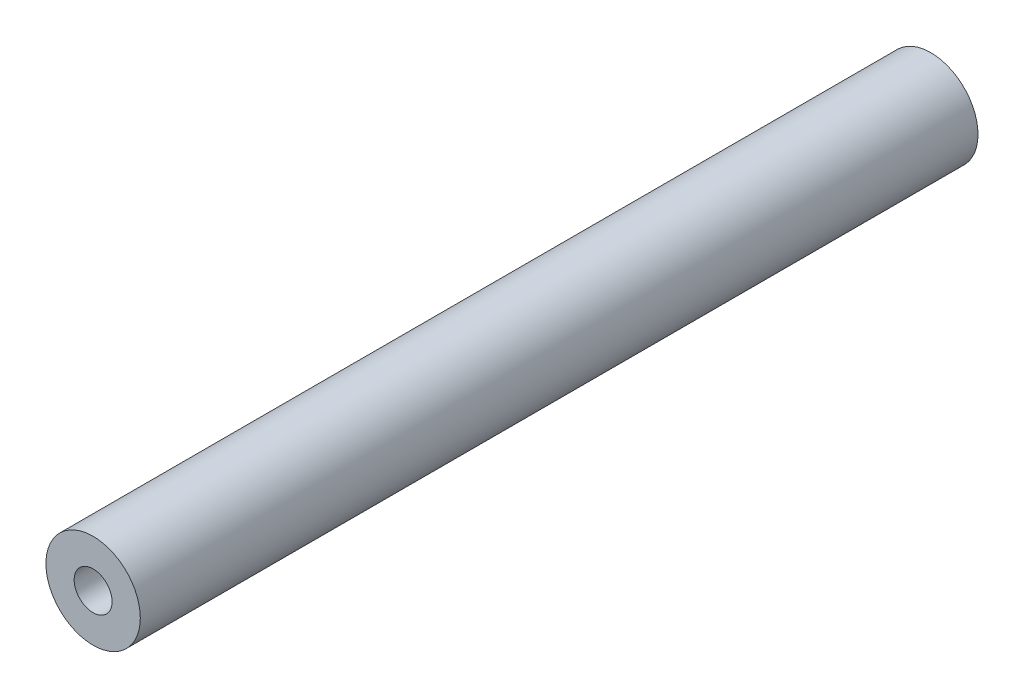
ISO-10303-21;
HEADER;
FILE_DESCRIPTION(('STEP AP214'),'2;1');
FILE_NAME('part.step','',(''),(''),'','','');
FILE_SCHEMA(('AUTOMOTIVE_DESIGN { 1 0 10303 214 1 1 1 1 }'));
ENDSEC;
DATA;
#1=APPLICATION_CONTEXT('core data for automotive mechanical design processes');
#2=APPLICATION_PROTOCOL_DEFINITION('international standard','automotive_design',2000,#1);
#3=PRODUCT_CONTEXT('',#1,'mechanical');
#4=PRODUCT('Part','Part','',(#3));
#5=PRODUCT_RELATED_PRODUCT_CATEGORY('part','',(#4));
#6=PRODUCT_DEFINITION_FORMATION('','',#4);
#7=PRODUCT_DEFINITION_CONTEXT('part definition',#1,'design');
#8=PRODUCT_DEFINITION('design','',#6,#7);
#9=PRODUCT_DEFINITION_SHAPE('','',#8);
#10=(LENGTH_UNIT() NAMED_UNIT(*) SI_UNIT(.MILLI.,.METRE.));
#11=(NAMED_UNIT(*) PLANE_ANGLE_UNIT() SI_UNIT($,.RADIAN.));
#12=(NAMED_UNIT(*) SI_UNIT($,.STERADIAN.) SOLID_ANGLE_UNIT());
#13=UNCERTAINTY_MEASURE_WITH_UNIT(LENGTH_MEASURE(1.E-05),#10,'distance_accuracy_value','');
#14=(GEOMETRIC_REPRESENTATION_CONTEXT(3) GLOBAL_UNCERTAINTY_ASSIGNED_CONTEXT((#13)) GLOBAL_UNIT_ASSIGNED_CONTEXT((#10,
#11,#12)) REPRESENTATION_CONTEXT('',''));
#15=CARTESIAN_POINT('',(0.,0.,0.));
#16=DIRECTION('',(0.,0.,1.));
#17=DIRECTION('',(1.,0.,0.));
#18=AXIS2_PLACEMENT_3D('',#15,#16,#17);
#19=CARTESIAN_POINT('',(0.,0.,56.35625));
#20=DIRECTION('',(0.,0.,-1.));
#21=DIRECTION('',(-1.,0.,0.));
#22=AXIS2_PLACEMENT_3D('',#19,#20,#21);
#23=CYLINDRICAL_SURFACE('',#22,6.35);
#24=CARTESIAN_POINT('',(0.,0.,56.35625));
#25=DIRECTION('',(0.,0.,1.));
#26=DIRECTION('',(1.,0.,0.));
#27=AXIS2_PLACEMENT_3D('',#24,#25,#26);
#28=CIRCLE('',#27,6.35);
#29=CARTESIAN_POINT('',(6.35,0.,56.35625));
#30=VERTEX_POINT('',#29);
#31=EDGE_CURVE('E11',#30,#30,#28,.T.);
#32=ORIENTED_EDGE('',*,*,#31,.F.);
#33=EDGE_LOOP('',(#32));
#34=FACE_BOUND('',#33,.T.);
#35=CARTESIAN_POINT('',(0.,0.,-56.35625));
#36=DIRECTION('',(0.,0.,1.));
#37=DIRECTION('',(1.,0.,0.));
#38=AXIS2_PLACEMENT_3D('',#35,#36,#37);
#39=CIRCLE('',#38,6.35);
#40=CARTESIAN_POINT('',(6.35,0.,-56.35625));
#41=VERTEX_POINT('',#40);
#42=EDGE_CURVE('E39',#41,#41,#39,.T.);
#43=ORIENTED_EDGE('',*,*,#42,.T.);
#44=EDGE_LOOP('',(#43));
#45=FACE_BOUND('',#44,.T.);
#46=ADVANCED_FACE('F36',(#34,#45),#23,.T.);
#47=CARTESIAN_POINT('',(0.,0.,56.35625));
#48=DIRECTION('',(0.,0.,1.));
#49=DIRECTION('',(1.,0.,0.));
#50=AXIS2_PLACEMENT_3D('',#47,#48,#49);
#51=PLANE('',#50);
#52=CARTESIAN_POINT('',(0.,0.,56.35625));
#53=DIRECTION('',(0.,0.,1.));
#54=DIRECTION('',(1.,0.,0.));
#55=AXIS2_PLACEMENT_3D('',#52,#53,#54);
#56=CIRCLE('',#55,2.55269999999999);
#57=CARTESIAN_POINT('',(2.55269999999999,0.,56.35625));
#58=VERTEX_POINT('',#57);
#59=EDGE_CURVE('E59',#58,#58,#56,.T.);
#60=ORIENTED_EDGE('',*,*,#59,.F.);
#61=EDGE_LOOP('',(#60));
#62=FACE_BOUND('',#61,.T.);
#63=ORIENTED_EDGE('',*,*,#31,.T.);
#64=EDGE_LOOP('',(#63));
#65=FACE_BOUND('',#64,.T.);
#66=ADVANCED_FACE('F78',(#62,#65),#51,.T.);
#67=CARTESIAN_POINT('',(0.,0.,-56.35625));
#68=DIRECTION('',(0.,0.,1.));
#69=DIRECTION('',(1.,0.,0.));
#70=AXIS2_PLACEMENT_3D('',#67,#68,#69);
#71=PLANE('',#70);
#72=CARTESIAN_POINT('',(0.,0.,-56.35625));
#73=DIRECTION('',(0.,0.,-1.));
#74=DIRECTION('',(-1.,0.,0.));
#75=AXIS2_PLACEMENT_3D('',#72,#73,#74);
#76=CIRCLE('',#75,2.55269999999999);
#77=CARTESIAN_POINT('',(-2.55269999999999,0.,-56.35625));
#78=VERTEX_POINT('',#77);
#79=EDGE_CURVE('E60',#78,#78,#76,.T.);
#80=ORIENTED_EDGE('',*,*,#79,.F.);
#81=EDGE_LOOP('',(#80));
#82=FACE_BOUND('',#81,.T.);
#83=ORIENTED_EDGE('',*,*,#42,.F.);
#84=EDGE_LOOP('',(#83));
#85=FACE_BOUND('',#84,.T.);
#86=ADVANCED_FACE('F75',(#82,#85),#71,.F.);
#87=CARTESIAN_POINT('',(0.,0.,37.30625));
#88=DIRECTION('',(0.,0.,1.));
#89=DIRECTION('',(1.,0.,0.));
#90=AXIS2_PLACEMENT_3D('',#87,#88,#89);
#91=CONICAL_SURFACE('',#90,2.55269999999999,1.02974425867665);
#92=CARTESIAN_POINT('',(0.,0.,35.7724330978083));
#93=VERTEX_POINT('',#92);
#94=VERTEX_LOOP('',#93);
#95=FACE_BOUND('',#94,.T.);
#96=CARTESIAN_POINT('',(0.,0.,37.30625));
#97=DIRECTION('',(0.,0.,1.));
#98=DIRECTION('',(1.,0.,0.));
#99=AXIS2_PLACEMENT_3D('',#96,#97,#98);
#100=CIRCLE('',#99,2.55269999999999);
#101=CARTESIAN_POINT('',(2.55269999999999,0.,37.30625));
#102=VERTEX_POINT('',#101);
#103=EDGE_CURVE('E63',#102,#102,#100,.T.);
#104=ORIENTED_EDGE('',*,*,#103,.T.);
#105=EDGE_LOOP('',(#104));
#106=FACE_BOUND('',#105,.T.);
#107=ADVANCED_FACE('F77',(#95,#106),#91,.F.);
#108=CARTESIAN_POINT('',(0.,0.,56.35625));
#109=DIRECTION('',(0.,0.,1.));
#110=DIRECTION('',(1.,0.,0.));
#111=AXIS2_PLACEMENT_3D('',#108,#109,#110);
#112=CYLINDRICAL_SURFACE('',#111,2.55269999999999);
#113=ORIENTED_EDGE('',*,*,#103,.F.);
#114=EDGE_LOOP('',(#113));
#115=FACE_BOUND('',#114,.T.);
#116=ORIENTED_EDGE('',*,*,#59,.T.);
#117=EDGE_LOOP('',(#116));
#118=FACE_BOUND('',#117,.T.);
#119=ADVANCED_FACE('F53',(#115,#118),#112,.F.);
#120=CARTESIAN_POINT('',(0.,0.,-37.30625));
#121=DIRECTION('',(0.,0.,-1.));
#122=DIRECTION('',(-1.,0.,0.));
#123=AXIS2_PLACEMENT_3D('',#120,#121,#122);
#124=CONICAL_SURFACE('',#123,2.55269999999999,1.02974425867665);
#125=CARTESIAN_POINT('',(0.,0.,-35.7724330978083));
#126=VERTEX_POINT('',#125);
#127=VERTEX_LOOP('',#126);
#128=FACE_BOUND('',#127,.T.);
#129=CARTESIAN_POINT('',(0.,0.,-37.30625));
#130=DIRECTION('',(0.,0.,-1.));
#131=DIRECTION('',(-1.,0.,0.));
#132=AXIS2_PLACEMENT_3D('',#129,#130,#131);
#133=CIRCLE('',#132,2.55269999999999);
#134=CARTESIAN_POINT('',(-2.55269999999999,0.,-37.30625));
#135=VERTEX_POINT('',#134);
#136=EDGE_CURVE('E57',#135,#135,#133,.T.);
#137=ORIENTED_EDGE('',*,*,#136,.T.);
#138=EDGE_LOOP('',(#137));
#139=FACE_BOUND('',#138,.T.);
#140=ADVANCED_FACE('F49',(#128,#139),#124,.F.);
#141=CARTESIAN_POINT('',(0.,0.,-56.35625));
#142=DIRECTION('',(0.,0.,-1.));
#143=DIRECTION('',(-1.,0.,0.));
#144=AXIS2_PLACEMENT_3D('',#141,#142,#143);
#145=CYLINDRICAL_SURFACE('',#144,2.55269999999999);
#146=ORIENTED_EDGE('',*,*,#136,.F.);
#147=EDGE_LOOP('',(#146));
#148=FACE_BOUND('',#147,.T.);
#149=ORIENTED_EDGE('',*,*,#79,.T.);
#150=EDGE_LOOP('',(#149));
#151=FACE_BOUND('',#150,.T.);
#152=ADVANCED_FACE('F52',(#148,#151),#145,.F.);
#153=CLOSED_SHELL('',(#46,#66,#86,#107,#119,#140,#152));
#154=MANIFOLD_SOLID_BREP('B2',#153);
#155=ADVANCED_BREP_SHAPE_REPRESENTATION('',(#18,#154),#14);
#156=SHAPE_DEFINITION_REPRESENTATION(#9,#155);
ENDSEC;
END-ISO-10303-21;
